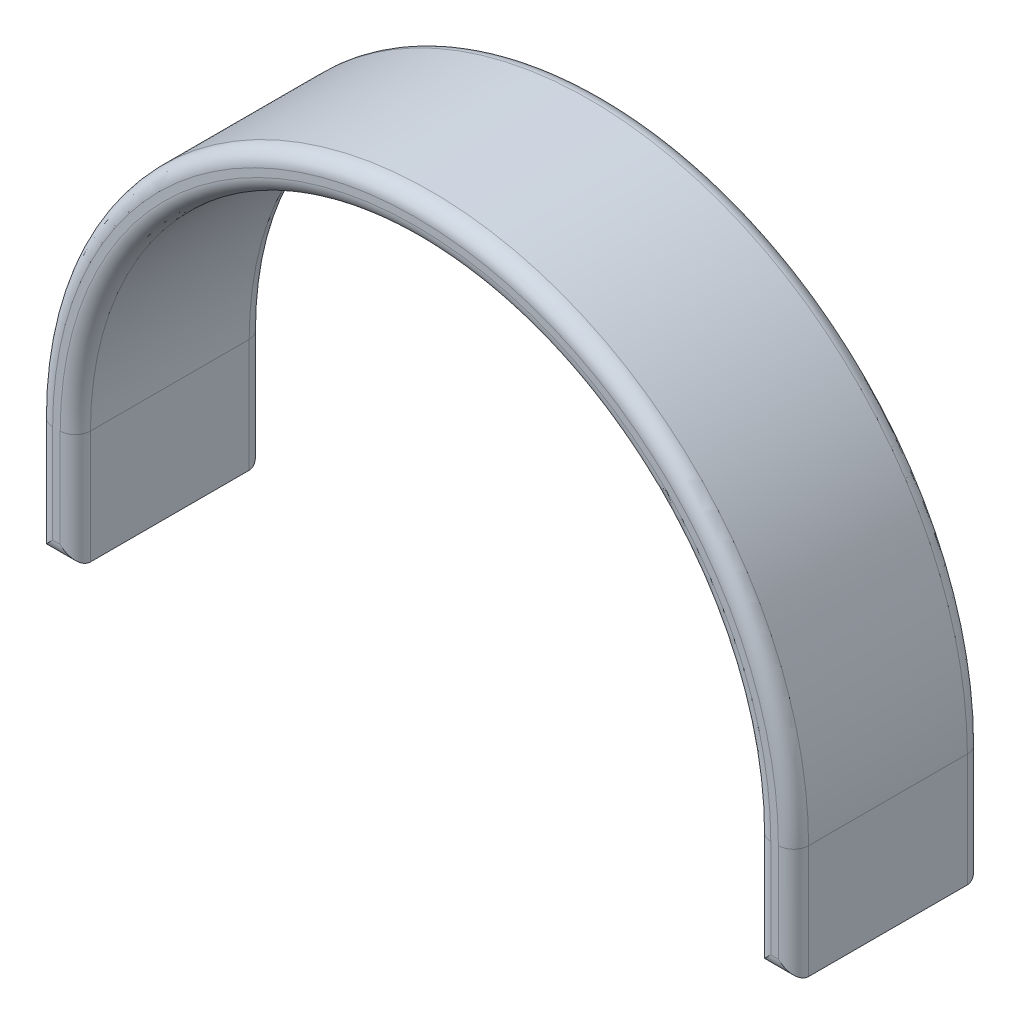
ISO-10303-21;
HEADER;
FILE_DESCRIPTION(('STEP AP214'),'2;1');
FILE_NAME('part.step','',(''),(''),'','','');
FILE_SCHEMA(('AUTOMOTIVE_DESIGN { 1 0 10303 214 1 1 1 1 }'));
ENDSEC;
DATA;
#1=APPLICATION_CONTEXT('core data for automotive mechanical design processes');
#2=APPLICATION_PROTOCOL_DEFINITION('international standard','automotive_design',2000,#1);
#3=PRODUCT_CONTEXT('',#1,'mechanical');
#4=PRODUCT('Part','Part','',(#3));
#5=PRODUCT_RELATED_PRODUCT_CATEGORY('part','',(#4));
#6=PRODUCT_DEFINITION_FORMATION('','',#4);
#7=PRODUCT_DEFINITION_CONTEXT('part definition',#1,'design');
#8=PRODUCT_DEFINITION('design','',#6,#7);
#9=PRODUCT_DEFINITION_SHAPE('','',#8);
#10=(LENGTH_UNIT() NAMED_UNIT(*) SI_UNIT(.MILLI.,.METRE.));
#11=(NAMED_UNIT(*) PLANE_ANGLE_UNIT() SI_UNIT($,.RADIAN.));
#12=(NAMED_UNIT(*) SI_UNIT($,.STERADIAN.) SOLID_ANGLE_UNIT());
#13=UNCERTAINTY_MEASURE_WITH_UNIT(LENGTH_MEASURE(1.E-05),#10,'distance_accuracy_value','');
#14=(GEOMETRIC_REPRESENTATION_CONTEXT(3) GLOBAL_UNCERTAINTY_ASSIGNED_CONTEXT((#13)) GLOBAL_UNIT_ASSIGNED_CONTEXT((#10,
#11,#12)) REPRESENTATION_CONTEXT('',''));
#15=CARTESIAN_POINT('',(0.,0.,0.));
#16=DIRECTION('',(0.,0.,1.));
#17=DIRECTION('',(1.,0.,0.));
#18=AXIS2_PLACEMENT_3D('',#15,#16,#17);
#19=CARTESIAN_POINT('',(0.,0.,25.));
#20=DIRECTION('',(0.,0.,-1.));
#21=DIRECTION('',(-1.,0.,0.));
#22=AXIS2_PLACEMENT_3D('',#19,#20,#21);
#23=CYLINDRICAL_SURFACE('',#22,50.);
#24=DIRECTION('',(0.,0.,-1.));
#25=VECTOR('',#24,1.);
#26=CARTESIAN_POINT('',(50.,0.,25.));
#27=LINE('',#26,#25);
#28=CARTESIAN_POINT('',(50.,0.,23.));
#29=VERTEX_POINT('',#28);
#30=CARTESIAN_POINT('',(50.,0.,2.));
#31=VERTEX_POINT('',#30);
#32=EDGE_CURVE('E271',#29,#31,#27,.T.);
#33=ORIENTED_EDGE('',*,*,#32,.T.);
#34=CARTESIAN_POINT('',(0.,0.,2.));
#35=DIRECTION('',(0.,0.,-1.));
#36=DIRECTION('',(-1.,0.,0.));
#37=AXIS2_PLACEMENT_3D('',#34,#35,#36);
#38=CIRCLE('',#37,50.);
#39=CARTESIAN_POINT('',(-50.,0.,2.));
#40=VERTEX_POINT('',#39);
#41=EDGE_CURVE('E236',#31,#40,#38,.F.);
#42=ORIENTED_EDGE('',*,*,#41,.T.);
#43=DIRECTION('',(0.,0.,-1.));
#44=VECTOR('',#43,1.);
#45=CARTESIAN_POINT('',(-50.,0.,25.));
#46=LINE('',#45,#44);
#47=CARTESIAN_POINT('',(-50.,0.,23.));
#48=VERTEX_POINT('',#47);
#49=EDGE_CURVE('E175',#48,#40,#46,.T.);
#50=ORIENTED_EDGE('',*,*,#49,.F.);
#51=CARTESIAN_POINT('',(0.,0.,23.));
#52=DIRECTION('',(0.,0.,-1.));
#53=DIRECTION('',(-1.,0.,0.));
#54=AXIS2_PLACEMENT_3D('',#51,#52,#53);
#55=CIRCLE('',#54,50.);
#56=EDGE_CURVE('E234',#48,#29,#55,.T.);
#57=ORIENTED_EDGE('',*,*,#56,.T.);
#58=EDGE_LOOP('',(#33,#42,#50,#57));
#59=FACE_BOUND('',#58,.T.);
#60=ADVANCED_FACE('F39',(#59),#23,.T.);
#61=CARTESIAN_POINT('',(-50.,0.,25.));
#62=DIRECTION('',(1.,0.,0.));
#63=DIRECTION('',(0.,0.,-1.));
#64=AXIS2_PLACEMENT_3D('',#61,#62,#63);
#65=PLANE('',#64);
#66=ORIENTED_EDGE('',*,*,#49,.T.);
#67=DIRECTION('',(0.,-1.,0.));
#68=VECTOR('',#67,1.);
#69=CARTESIAN_POINT('',(-50.,-15.,2.));
#70=LINE('',#69,#68);
#71=CARTESIAN_POINT('',(-50.,-15.,2.));
#72=VERTEX_POINT('',#71);
#73=EDGE_CURVE('E174',#40,#72,#70,.T.);
#74=ORIENTED_EDGE('',*,*,#73,.T.);
#75=DIRECTION('',(0.,0.,-1.));
#76=VECTOR('',#75,1.);
#77=CARTESIAN_POINT('',(-50.,-15.,25.));
#78=LINE('',#77,#76);
#79=CARTESIAN_POINT('',(-50.,-15.,23.));
#80=VERTEX_POINT('',#79);
#81=EDGE_CURVE('E156',#80,#72,#78,.T.);
#82=ORIENTED_EDGE('',*,*,#81,.F.);
#83=DIRECTION('',(0.,-1.,0.));
#84=VECTOR('',#83,1.);
#85=CARTESIAN_POINT('',(-50.,0.,23.));
#86=LINE('',#85,#84);
#87=EDGE_CURVE('E171',#80,#48,#86,.F.);
#88=ORIENTED_EDGE('',*,*,#87,.T.);
#89=EDGE_LOOP('',(#66,#74,#82,#88));
#90=FACE_BOUND('',#89,.T.);
#91=ADVANCED_FACE('F169',(#90),#65,.F.);
#92=CARTESIAN_POINT('',(-50.,-15.,25.));
#93=DIRECTION('',(0.,1.,0.));
#94=DIRECTION('',(0.,0.,1.));
#95=AXIS2_PLACEMENT_3D('',#92,#93,#94);
#96=PLANE('',#95);
#97=ORIENTED_EDGE('',*,*,#81,.T.);
#98=DIRECTION('',(1.,0.,0.));
#99=VECTOR('',#98,1.);
#100=CARTESIAN_POINT('',(-45.,-15.,2.));
#101=LINE('',#100,#99);
#102=CARTESIAN_POINT('',(-45.,-15.,2.));
#103=VERTEX_POINT('',#102);
#104=EDGE_CURVE('E163',#72,#103,#101,.T.);
#105=ORIENTED_EDGE('',*,*,#104,.T.);
#106=DIRECTION('',(0.,0.,-1.));
#107=VECTOR('',#106,1.);
#108=CARTESIAN_POINT('',(-45.,-15.,25.));
#109=LINE('',#108,#107);
#110=CARTESIAN_POINT('',(-45.,-15.,23.));
#111=VERTEX_POINT('',#110);
#112=EDGE_CURVE('E158',#111,#103,#109,.T.);
#113=ORIENTED_EDGE('',*,*,#112,.F.);
#114=DIRECTION('',(1.,0.,0.));
#115=VECTOR('',#114,1.);
#116=CARTESIAN_POINT('',(-50.,-15.,23.));
#117=LINE('',#116,#115);
#118=EDGE_CURVE('E153',#111,#80,#117,.F.);
#119=ORIENTED_EDGE('',*,*,#118,.T.);
#120=EDGE_LOOP('',(#97,#105,#113,#119));
#121=FACE_BOUND('',#120,.T.);
#122=ADVANCED_FACE('F155',(#121),#96,.F.);
#123=CARTESIAN_POINT('',(-45.,0.,25.));
#124=DIRECTION('',(-1.,0.,0.));
#125=DIRECTION('',(0.,0.,1.));
#126=AXIS2_PLACEMENT_3D('',#123,#124,#125);
#127=PLANE('',#126);
#128=ORIENTED_EDGE('',*,*,#112,.T.);
#129=DIRECTION('',(0.,1.,0.));
#130=VECTOR('',#129,1.);
#131=CARTESIAN_POINT('',(-45.,0.,2.));
#132=LINE('',#131,#130);
#133=CARTESIAN_POINT('',(-45.,0.,2.));
#134=VERTEX_POINT('',#133);
#135=EDGE_CURVE('E215',#103,#134,#132,.T.);
#136=ORIENTED_EDGE('',*,*,#135,.T.);
#137=DIRECTION('',(0.,0.,-1.));
#138=VECTOR('',#137,1.);
#139=CARTESIAN_POINT('',(-45.,0.,25.));
#140=LINE('',#139,#138);
#141=CARTESIAN_POINT('',(-45.,0.,23.));
#142=VERTEX_POINT('',#141);
#143=EDGE_CURVE('E296',#142,#134,#140,.T.);
#144=ORIENTED_EDGE('',*,*,#143,.F.);
#145=DIRECTION('',(0.,1.,0.));
#146=VECTOR('',#145,1.);
#147=CARTESIAN_POINT('',(-45.,0.,23.));
#148=LINE('',#147,#146);
#149=EDGE_CURVE('E213',#142,#111,#148,.F.);
#150=ORIENTED_EDGE('',*,*,#149,.T.);
#151=EDGE_LOOP('',(#128,#136,#144,#150));
#152=FACE_BOUND('',#151,.T.);
#153=ADVANCED_FACE('F293',(#152),#127,.F.);
#154=CARTESIAN_POINT('',(0.,0.,25.));
#155=DIRECTION('',(0.,0.,-1.));
#156=DIRECTION('',(-1.,0.,0.));
#157=AXIS2_PLACEMENT_3D('',#154,#155,#156);
#158=CYLINDRICAL_SURFACE('',#157,45.);
#159=ORIENTED_EDGE('',*,*,#143,.T.);
#160=CARTESIAN_POINT('',(0.,0.,2.));
#161=DIRECTION('',(0.,0.,-1.));
#162=DIRECTION('',(-1.,0.,0.));
#163=AXIS2_PLACEMENT_3D('',#160,#161,#162);
#164=CIRCLE('',#163,45.);
#165=CARTESIAN_POINT('',(45.,0.,2.));
#166=VERTEX_POINT('',#165);
#167=EDGE_CURVE('E219',#134,#166,#164,.T.);
#168=ORIENTED_EDGE('',*,*,#167,.T.);
#169=DIRECTION('',(0.,0.,-1.));
#170=VECTOR('',#169,1.);
#171=CARTESIAN_POINT('',(45.,0.,25.));
#172=LINE('',#171,#170);
#173=CARTESIAN_POINT('',(45.,0.,23.));
#174=VERTEX_POINT('',#173);
#175=EDGE_CURVE('E299',#174,#166,#172,.T.);
#176=ORIENTED_EDGE('',*,*,#175,.F.);
#177=CARTESIAN_POINT('',(0.,0.,23.));
#178=DIRECTION('',(0.,0.,-1.));
#179=DIRECTION('',(-1.,0.,0.));
#180=AXIS2_PLACEMENT_3D('',#177,#178,#179);
#181=CIRCLE('',#180,45.);
#182=EDGE_CURVE('E217',#174,#142,#181,.F.);
#183=ORIENTED_EDGE('',*,*,#182,.T.);
#184=EDGE_LOOP('',(#159,#168,#176,#183));
#185=FACE_BOUND('',#184,.T.);
#186=ADVANCED_FACE('F344',(#185),#158,.F.);
#187=CARTESIAN_POINT('',(45.,0.,25.));
#188=DIRECTION('',(1.,0.,0.));
#189=DIRECTION('',(0.,0.,-1.));
#190=AXIS2_PLACEMENT_3D('',#187,#188,#189);
#191=PLANE('',#190);
#192=ORIENTED_EDGE('',*,*,#175,.T.);
#193=DIRECTION('',(0.,-1.,0.));
#194=VECTOR('',#193,1.);
#195=CARTESIAN_POINT('',(45.,-15.,2.));
#196=LINE('',#195,#194);
#197=CARTESIAN_POINT('',(45.,-15.,2.));
#198=VERTEX_POINT('',#197);
#199=EDGE_CURVE('E223',#166,#198,#196,.T.);
#200=ORIENTED_EDGE('',*,*,#199,.T.);
#201=DIRECTION('',(0.,0.,-1.));
#202=VECTOR('',#201,1.);
#203=CARTESIAN_POINT('',(45.,-15.,25.));
#204=LINE('',#203,#202);
#205=CARTESIAN_POINT('',(45.,-15.,23.));
#206=VERTEX_POINT('',#205);
#207=EDGE_CURVE('E303',#206,#198,#204,.T.);
#208=ORIENTED_EDGE('',*,*,#207,.F.);
#209=DIRECTION('',(0.,-1.,0.));
#210=VECTOR('',#209,1.);
#211=CARTESIAN_POINT('',(45.,0.,23.));
#212=LINE('',#211,#210);
#213=EDGE_CURVE('E221',#206,#174,#212,.F.);
#214=ORIENTED_EDGE('',*,*,#213,.T.);
#215=EDGE_LOOP('',(#192,#200,#208,#214));
#216=FACE_BOUND('',#215,.T.);
#217=ADVANCED_FACE('F347',(#216),#191,.F.);
#218=CARTESIAN_POINT('',(45.,-15.,25.));
#219=DIRECTION('',(0.,1.,0.));
#220=DIRECTION('',(0.,0.,1.));
#221=AXIS2_PLACEMENT_3D('',#218,#219,#220);
#222=PLANE('',#221);
#223=ORIENTED_EDGE('',*,*,#207,.T.);
#224=DIRECTION('',(1.,0.,0.));
#225=VECTOR('',#224,1.);
#226=CARTESIAN_POINT('',(50.,-15.,2.));
#227=LINE('',#226,#225);
#228=CARTESIAN_POINT('',(50.,-15.,2.));
#229=VERTEX_POINT('',#228);
#230=EDGE_CURVE('E227',#198,#229,#227,.T.);
#231=ORIENTED_EDGE('',*,*,#230,.T.);
#232=DIRECTION('',(0.,0.,-1.));
#233=VECTOR('',#232,1.);
#234=CARTESIAN_POINT('',(50.,-15.,25.));
#235=LINE('',#234,#233);
#236=CARTESIAN_POINT('',(50.,-15.,23.));
#237=VERTEX_POINT('',#236);
#238=EDGE_CURVE('E308',#237,#229,#235,.T.);
#239=ORIENTED_EDGE('',*,*,#238,.F.);
#240=DIRECTION('',(1.,0.,0.));
#241=VECTOR('',#240,1.);
#242=CARTESIAN_POINT('',(45.,-15.,23.));
#243=LINE('',#242,#241);
#244=EDGE_CURVE('E225',#237,#206,#243,.F.);
#245=ORIENTED_EDGE('',*,*,#244,.T.);
#246=EDGE_LOOP('',(#223,#231,#239,#245));
#247=FACE_BOUND('',#246,.T.);
#248=ADVANCED_FACE('F361',(#247),#222,.F.);
#249=CARTESIAN_POINT('',(50.,0.,25.));
#250=DIRECTION('',(-1.,0.,0.));
#251=DIRECTION('',(0.,-1.,0.));
#252=AXIS2_PLACEMENT_3D('',#249,#250,#251);
#253=PLANE('',#252);
#254=ORIENTED_EDGE('',*,*,#238,.T.);
#255=DIRECTION('',(0.,1.,0.));
#256=VECTOR('',#255,1.);
#257=CARTESIAN_POINT('',(50.,0.,2.));
#258=LINE('',#257,#256);
#259=EDGE_CURVE('E232',#229,#31,#258,.T.);
#260=ORIENTED_EDGE('',*,*,#259,.T.);
#261=ORIENTED_EDGE('',*,*,#32,.F.);
#262=DIRECTION('',(0.,1.,0.));
#263=VECTOR('',#262,1.);
#264=CARTESIAN_POINT('',(50.,0.,23.));
#265=LINE('',#264,#263);
#266=EDGE_CURVE('E229',#29,#237,#265,.F.);
#267=ORIENTED_EDGE('',*,*,#266,.T.);
#268=EDGE_LOOP('',(#254,#260,#261,#267));
#269=FACE_BOUND('',#268,.T.);
#270=ADVANCED_FACE('F362',(#269),#253,.F.);
#271=CARTESIAN_POINT('',(0.,0.,25.));
#272=DIRECTION('',(0.,0.,-1.));
#273=DIRECTION('',(-1.,0.,0.));
#274=AXIS2_PLACEMENT_3D('',#271,#272,#273);
#275=PLANE('',#274);
#276=DIRECTION('',(1.,0.,0.));
#277=VECTOR('',#276,1.);
#278=CARTESIAN_POINT('',(0.,-13.,25.));
#279=LINE('',#278,#277);
#280=CARTESIAN_POINT('',(47.,-13.,25.));
#281=VERTEX_POINT('',#280);
#282=CARTESIAN_POINT('',(48.,-13.,25.));
#283=VERTEX_POINT('',#282);
#284=EDGE_CURVE('E48',#281,#283,#279,.T.);
#285=ORIENTED_EDGE('',*,*,#284,.T.);
#286=DIRECTION('',(0.,1.,0.));
#287=VECTOR('',#286,1.);
#288=CARTESIAN_POINT('',(48.,0.,25.));
#289=LINE('',#288,#287);
#290=CARTESIAN_POINT('',(48.,0.,25.));
#291=VERTEX_POINT('',#290);
#292=EDGE_CURVE('E11',#283,#291,#289,.T.);
#293=ORIENTED_EDGE('',*,*,#292,.T.);
#294=CARTESIAN_POINT('',(0.,0.,25.));
#295=DIRECTION('',(0.,0.,-1.));
#296=DIRECTION('',(-1.,0.,0.));
#297=AXIS2_PLACEMENT_3D('',#294,#295,#296);
#298=CIRCLE('',#297,48.);
#299=CARTESIAN_POINT('',(-48.,0.,25.));
#300=VERTEX_POINT('',#299);
#301=EDGE_CURVE('E238',#291,#300,#298,.F.);
#302=ORIENTED_EDGE('',*,*,#301,.T.);
#303=DIRECTION('',(0.,-1.,0.));
#304=VECTOR('',#303,1.);
#305=CARTESIAN_POINT('',(-48.,0.,25.));
#306=LINE('',#305,#304);
#307=CARTESIAN_POINT('',(-48.,-13.,25.));
#308=VERTEX_POINT('',#307);
#309=EDGE_CURVE('E240',#300,#308,#306,.T.);
#310=ORIENTED_EDGE('',*,*,#309,.T.);
#311=DIRECTION('',(1.,0.,0.));
#312=VECTOR('',#311,1.);
#313=CARTESIAN_POINT('',(0.,-13.,25.));
#314=LINE('',#313,#312);
#315=CARTESIAN_POINT('',(-47.,-13.,25.));
#316=VERTEX_POINT('',#315);
#317=EDGE_CURVE('E181',#308,#316,#314,.T.);
#318=ORIENTED_EDGE('',*,*,#317,.T.);
#319=DIRECTION('',(0.,1.,0.));
#320=VECTOR('',#319,1.);
#321=CARTESIAN_POINT('',(-47.,0.,25.));
#322=LINE('',#321,#320);
#323=CARTESIAN_POINT('',(-47.,0.,25.));
#324=VERTEX_POINT('',#323);
#325=EDGE_CURVE('E243',#316,#324,#322,.T.);
#326=ORIENTED_EDGE('',*,*,#325,.T.);
#327=CARTESIAN_POINT('',(0.,0.,25.));
#328=DIRECTION('',(0.,0.,-1.));
#329=DIRECTION('',(-1.,0.,0.));
#330=AXIS2_PLACEMENT_3D('',#327,#328,#329);
#331=CIRCLE('',#330,47.);
#332=CARTESIAN_POINT('',(47.,0.,25.));
#333=VERTEX_POINT('',#332);
#334=EDGE_CURVE('E245',#324,#333,#331,.T.);
#335=ORIENTED_EDGE('',*,*,#334,.T.);
#336=DIRECTION('',(0.,-1.,0.));
#337=VECTOR('',#336,1.);
#338=CARTESIAN_POINT('',(47.,0.,25.));
#339=LINE('',#338,#337);
#340=EDGE_CURVE('E59',#333,#281,#339,.T.);
#341=ORIENTED_EDGE('',*,*,#340,.T.);
#342=EDGE_LOOP('',(#285,#293,#302,#310,#318,#326,#335,#341));
#343=FACE_BOUND('',#342,.T.);
#344=ADVANCED_FACE('F371',(#343),#275,.F.);
#345=CARTESIAN_POINT('',(0.,0.,0.));
#346=DIRECTION('',(0.,0.,-1.));
#347=DIRECTION('',(-1.,0.,0.));
#348=AXIS2_PLACEMENT_3D('',#345,#346,#347);
#349=PLANE('',#348);
#350=DIRECTION('',(1.,0.,0.));
#351=VECTOR('',#350,1.);
#352=CARTESIAN_POINT('',(-50.,-13.,0.));
#353=LINE('',#352,#351);
#354=CARTESIAN_POINT('',(-47.,-13.,0.));
#355=VERTEX_POINT('',#354);
#356=CARTESIAN_POINT('',(-48.,-13.,0.));
#357=VERTEX_POINT('',#356);
#358=EDGE_CURVE('E208',#355,#357,#353,.F.);
#359=ORIENTED_EDGE('',*,*,#358,.T.);
#360=DIRECTION('',(0.,-1.,0.));
#361=VECTOR('',#360,1.);
#362=CARTESIAN_POINT('',(-48.,0.,0.));
#363=LINE('',#362,#361);
#364=CARTESIAN_POINT('',(-48.,0.,0.));
#365=VERTEX_POINT('',#364);
#366=EDGE_CURVE('E164',#357,#365,#363,.F.);
#367=ORIENTED_EDGE('',*,*,#366,.T.);
#368=CARTESIAN_POINT('',(0.,0.,0.));
#369=DIRECTION('',(0.,0.,-1.));
#370=DIRECTION('',(-1.,0.,0.));
#371=AXIS2_PLACEMENT_3D('',#368,#369,#370);
#372=CIRCLE('',#371,48.);
#373=CARTESIAN_POINT('',(48.,0.,0.));
#374=VERTEX_POINT('',#373);
#375=EDGE_CURVE('E193',#365,#374,#372,.T.);
#376=ORIENTED_EDGE('',*,*,#375,.T.);
#377=DIRECTION('',(0.,1.,0.));
#378=VECTOR('',#377,1.);
#379=CARTESIAN_POINT('',(48.,-15.,0.));
#380=LINE('',#379,#378);
#381=CARTESIAN_POINT('',(48.,-13.,0.));
#382=VERTEX_POINT('',#381);
#383=EDGE_CURVE('E198',#374,#382,#380,.F.);
#384=ORIENTED_EDGE('',*,*,#383,.T.);
#385=DIRECTION('',(1.,0.,0.));
#386=VECTOR('',#385,1.);
#387=CARTESIAN_POINT('',(45.,-13.,0.));
#388=LINE('',#387,#386);
#389=CARTESIAN_POINT('',(47.,-13.,0.));
#390=VERTEX_POINT('',#389);
#391=EDGE_CURVE('E200',#382,#390,#388,.F.);
#392=ORIENTED_EDGE('',*,*,#391,.T.);
#393=DIRECTION('',(0.,-1.,0.));
#394=VECTOR('',#393,1.);
#395=CARTESIAN_POINT('',(47.,0.,0.));
#396=LINE('',#395,#394);
#397=CARTESIAN_POINT('',(47.,0.,0.));
#398=VERTEX_POINT('',#397);
#399=EDGE_CURVE('E202',#390,#398,#396,.F.);
#400=ORIENTED_EDGE('',*,*,#399,.T.);
#401=CARTESIAN_POINT('',(0.,0.,0.));
#402=DIRECTION('',(0.,0.,-1.));
#403=DIRECTION('',(-1.,0.,0.));
#404=AXIS2_PLACEMENT_3D('',#401,#402,#403);
#405=CIRCLE('',#404,47.);
#406=CARTESIAN_POINT('',(-47.,0.,0.));
#407=VERTEX_POINT('',#406);
#408=EDGE_CURVE('E204',#398,#407,#405,.F.);
#409=ORIENTED_EDGE('',*,*,#408,.T.);
#410=DIRECTION('',(0.,1.,0.));
#411=VECTOR('',#410,1.);
#412=CARTESIAN_POINT('',(-47.,-15.,0.));
#413=LINE('',#412,#411);
#414=EDGE_CURVE('E206',#407,#355,#413,.F.);
#415=ORIENTED_EDGE('',*,*,#414,.T.);
#416=EDGE_LOOP('',(#359,#367,#376,#384,#392,#400,#409,#415));
#417=FACE_BOUND('',#416,.T.);
#418=ADVANCED_FACE('F373',(#417),#349,.T.);
#419=CARTESIAN_POINT('',(47.,0.,2.));
#420=DIRECTION('',(0.,1.,0.));
#421=DIRECTION('',(0.,0.,1.));
#422=AXIS2_PLACEMENT_3D('',#419,#420,#421);
#423=CYLINDRICAL_SURFACE('',#422,2.);
#424=CARTESIAN_POINT('',(47.,0.,2.));
#425=DIRECTION('',(0.,1.,0.));
#426=DIRECTION('',(-1.,0.,0.));
#427=AXIS2_PLACEMENT_3D('',#424,#425,#426);
#428=CIRCLE('',#427,2.);
#429=EDGE_CURVE('E265',#398,#166,#428,.T.);
#430=ORIENTED_EDGE('',*,*,#429,.F.);
#431=ORIENTED_EDGE('',*,*,#399,.F.);
#432=CARTESIAN_POINT('',(47.,-13.,2.));
#433=DIRECTION('',(-0.707106781186547,0.707106781186547,0.));
#434=DIRECTION('',(-0.707106781186547,-0.707106781186547,0.));
#435=AXIS2_PLACEMENT_3D('',#432,#433,#434);
#436=ELLIPSE('',#435,2.82842712474619,2.);
#437=EDGE_CURVE('E268',#198,#390,#436,.F.);
#438=ORIENTED_EDGE('',*,*,#437,.F.);
#439=ORIENTED_EDGE('',*,*,#199,.F.);
#440=EDGE_LOOP('',(#430,#431,#438,#439));
#441=FACE_BOUND('',#440,.T.);
#442=ADVANCED_FACE('F352',(#441),#423,.T.);
#443=CARTESIAN_POINT('',(45.,-13.,2.));
#444=DIRECTION('',(-1.,0.,0.));
#445=DIRECTION('',(0.,0.,1.));
#446=AXIS2_PLACEMENT_3D('',#443,#444,#445);
#447=CYLINDRICAL_SURFACE('',#446,2.);
#448=ORIENTED_EDGE('',*,*,#437,.T.);
#449=ORIENTED_EDGE('',*,*,#391,.F.);
#450=CARTESIAN_POINT('',(48.,-13.,2.));
#451=DIRECTION('',(-0.707106781186548,-0.707106781186547,0.));
#452=DIRECTION('',(0.707106781186547,-0.707106781186548,0.));
#453=AXIS2_PLACEMENT_3D('',#450,#451,#452);
#454=ELLIPSE('',#453,2.82842712474619,2.);
#455=EDGE_CURVE('E262',#229,#382,#454,.F.);
#456=ORIENTED_EDGE('',*,*,#455,.F.);
#457=ORIENTED_EDGE('',*,*,#230,.F.);
#458=EDGE_LOOP('',(#448,#449,#456,#457));
#459=FACE_BOUND('',#458,.T.);
#460=ADVANCED_FACE('F358',(#459),#447,.T.);
#461=CARTESIAN_POINT('',(0.,0.,2.));
#462=DIRECTION('',(0.,0.,-1.));
#463=DIRECTION('',(-1.,0.,0.));
#464=AXIS2_PLACEMENT_3D('',#461,#462,#463);
#465=TOROIDAL_SURFACE('',#464,47.,2.);
#466=ORIENTED_EDGE('',*,*,#429,.T.);
#467=ORIENTED_EDGE('',*,*,#167,.F.);
#468=CARTESIAN_POINT('',(-47.,0.,2.));
#469=DIRECTION('',(0.,-1.,0.));
#470=DIRECTION('',(0.,0.,-1.));
#471=AXIS2_PLACEMENT_3D('',#468,#469,#470);
#472=CIRCLE('',#471,2.);
#473=EDGE_CURVE('E259',#407,#134,#472,.T.);
#474=ORIENTED_EDGE('',*,*,#473,.F.);
#475=ORIENTED_EDGE('',*,*,#408,.F.);
#476=EDGE_LOOP('',(#466,#467,#474,#475));
#477=FACE_BOUND('',#476,.T.);
#478=ADVANCED_FACE('F341',(#477),#465,.T.);
#479=CARTESIAN_POINT('',(48.,0.,2.));
#480=DIRECTION('',(0.,-1.,0.));
#481=DIRECTION('',(1.,0.,0.));
#482=AXIS2_PLACEMENT_3D('',#479,#480,#481);
#483=CYLINDRICAL_SURFACE('',#482,2.);
#484=ORIENTED_EDGE('',*,*,#455,.T.);
#485=ORIENTED_EDGE('',*,*,#383,.F.);
#486=CARTESIAN_POINT('',(48.,0.,2.));
#487=DIRECTION('',(0.,1.,0.));
#488=DIRECTION('',(-1.,0.,0.));
#489=AXIS2_PLACEMENT_3D('',#486,#487,#488);
#490=CIRCLE('',#489,2.);
#491=EDGE_CURVE('E256',#31,#374,#490,.T.);
#492=ORIENTED_EDGE('',*,*,#491,.F.);
#493=ORIENTED_EDGE('',*,*,#259,.F.);
#494=EDGE_LOOP('',(#484,#485,#492,#493));
#495=FACE_BOUND('',#494,.T.);
#496=ADVANCED_FACE('F321',(#495),#483,.T.);
#497=CARTESIAN_POINT('',(-47.,0.,2.));
#498=DIRECTION('',(0.,-1.,0.));
#499=DIRECTION('',(0.,0.,-1.));
#500=AXIS2_PLACEMENT_3D('',#497,#498,#499);
#501=CYLINDRICAL_SURFACE('',#500,2.);
#502=ORIENTED_EDGE('',*,*,#473,.T.);
#503=ORIENTED_EDGE('',*,*,#135,.F.);
#504=CARTESIAN_POINT('',(-47.,-13.,2.));
#505=DIRECTION('',(-0.707106781186547,-0.707106781186547,0.));
#506=DIRECTION('',(0.707106781186547,-0.707106781186547,0.));
#507=AXIS2_PLACEMENT_3D('',#504,#505,#506);
#508=ELLIPSE('',#507,2.82842712474619,2.);
#509=EDGE_CURVE('E253',#355,#103,#508,.T.);
#510=ORIENTED_EDGE('',*,*,#509,.F.);
#511=ORIENTED_EDGE('',*,*,#414,.F.);
#512=EDGE_LOOP('',(#502,#503,#510,#511));
#513=FACE_BOUND('',#512,.T.);
#514=ADVANCED_FACE('F337',(#513),#501,.T.);
#515=CARTESIAN_POINT('',(0.,0.,2.));
#516=DIRECTION('',(0.,0.,-1.));
#517=DIRECTION('',(-1.,0.,0.));
#518=AXIS2_PLACEMENT_3D('',#515,#516,#517);
#519=TOROIDAL_SURFACE('',#518,48.,2.);
#520=ORIENTED_EDGE('',*,*,#491,.T.);
#521=ORIENTED_EDGE('',*,*,#375,.F.);
#522=CARTESIAN_POINT('',(-48.,0.,2.));
#523=DIRECTION('',(0.,-1.,0.));
#524=DIRECTION('',(0.,0.,-1.));
#525=AXIS2_PLACEMENT_3D('',#522,#523,#524);
#526=CIRCLE('',#525,2.);
#527=EDGE_CURVE('E251',#40,#365,#526,.T.);
#528=ORIENTED_EDGE('',*,*,#527,.F.);
#529=ORIENTED_EDGE('',*,*,#41,.F.);
#530=EDGE_LOOP('',(#520,#521,#528,#529));
#531=FACE_BOUND('',#530,.T.);
#532=ADVANCED_FACE('F325',(#531),#519,.T.);
#533=CARTESIAN_POINT('',(-50.,-13.,2.));
#534=DIRECTION('',(-1.,0.,0.));
#535=DIRECTION('',(0.,0.,1.));
#536=AXIS2_PLACEMENT_3D('',#533,#534,#535);
#537=CYLINDRICAL_SURFACE('',#536,2.);
#538=ORIENTED_EDGE('',*,*,#509,.T.);
#539=ORIENTED_EDGE('',*,*,#104,.F.);
#540=CARTESIAN_POINT('',(-48.,-13.,2.));
#541=DIRECTION('',(-0.707106781186547,0.707106781186547,0.));
#542=DIRECTION('',(-0.707106781186547,-0.707106781186547,0.));
#543=AXIS2_PLACEMENT_3D('',#540,#541,#542);
#544=ELLIPSE('',#543,2.82842712474619,2.);
#545=EDGE_CURVE('E249',#357,#72,#544,.T.);
#546=ORIENTED_EDGE('',*,*,#545,.F.);
#547=ORIENTED_EDGE('',*,*,#358,.F.);
#548=EDGE_LOOP('',(#538,#539,#546,#547));
#549=FACE_BOUND('',#548,.T.);
#550=ADVANCED_FACE('F333',(#549),#537,.T.);
#551=CARTESIAN_POINT('',(-48.,0.,2.));
#552=DIRECTION('',(0.,1.,0.));
#553=DIRECTION('',(0.,0.,1.));
#554=AXIS2_PLACEMENT_3D('',#551,#552,#553);
#555=CYLINDRICAL_SURFACE('',#554,2.);
#556=ORIENTED_EDGE('',*,*,#527,.T.);
#557=ORIENTED_EDGE('',*,*,#366,.F.);
#558=ORIENTED_EDGE('',*,*,#545,.T.);
#559=ORIENTED_EDGE('',*,*,#73,.F.);
#560=EDGE_LOOP('',(#556,#557,#558,#559));
#561=FACE_BOUND('',#560,.T.);
#562=ADVANCED_FACE('F328',(#561),#555,.T.);
#563=CARTESIAN_POINT('',(-47.,0.,23.));
#564=DIRECTION('',(0.,1.,0.));
#565=DIRECTION('',(0.,0.,1.));
#566=AXIS2_PLACEMENT_3D('',#563,#564,#565);
#567=CYLINDRICAL_SURFACE('',#566,2.);
#568=CARTESIAN_POINT('',(-47.,-13.,23.));
#569=DIRECTION('',(0.707106781186547,0.707106781186547,0.));
#570=DIRECTION('',(0.707106781186547,-0.707106781186547,0.));
#571=AXIS2_PLACEMENT_3D('',#568,#569,#570);
#572=ELLIPSE('',#571,2.82842712474619,2.);
#573=EDGE_CURVE('E280',#111,#316,#572,.F.);
#574=ORIENTED_EDGE('',*,*,#573,.F.);
#575=ORIENTED_EDGE('',*,*,#149,.F.);
#576=CARTESIAN_POINT('',(-47.,0.,23.));
#577=DIRECTION('',(0.,1.,0.));
#578=DIRECTION('',(-1.,0.,0.));
#579=AXIS2_PLACEMENT_3D('',#576,#577,#578);
#580=CIRCLE('',#579,2.);
#581=EDGE_CURVE('E43',#324,#142,#580,.T.);
#582=ORIENTED_EDGE('',*,*,#581,.F.);
#583=ORIENTED_EDGE('',*,*,#325,.F.);
#584=EDGE_LOOP('',(#574,#575,#582,#583));
#585=FACE_BOUND('',#584,.T.);
#586=ADVANCED_FACE('F41',(#585),#567,.T.);
#587=CARTESIAN_POINT('',(0.,0.,23.));
#588=DIRECTION('',(0.,0.,-1.));
#589=DIRECTION('',(-1.,0.,0.));
#590=AXIS2_PLACEMENT_3D('',#587,#588,#589);
#591=TOROIDAL_SURFACE('',#590,47.,2.);
#592=ORIENTED_EDGE('',*,*,#581,.T.);
#593=ORIENTED_EDGE('',*,*,#182,.F.);
#594=CARTESIAN_POINT('',(47.,0.,23.));
#595=DIRECTION('',(0.,-1.,0.));
#596=DIRECTION('',(0.,0.,-1.));
#597=AXIS2_PLACEMENT_3D('',#594,#595,#596);
#598=CIRCLE('',#597,2.);
#599=EDGE_CURVE('E184',#333,#174,#598,.T.);
#600=ORIENTED_EDGE('',*,*,#599,.F.);
#601=ORIENTED_EDGE('',*,*,#334,.F.);
#602=EDGE_LOOP('',(#592,#593,#600,#601));
#603=FACE_BOUND('',#602,.T.);
#604=ADVANCED_FACE('F286',(#603),#591,.T.);
#605=CARTESIAN_POINT('',(0.,-13.,23.));
#606=DIRECTION('',(1.,0.,0.));
#607=DIRECTION('',(0.,0.,-1.));
#608=AXIS2_PLACEMENT_3D('',#605,#606,#607);
#609=CYLINDRICAL_SURFACE('',#608,2.);
#610=ORIENTED_EDGE('',*,*,#573,.T.);
#611=ORIENTED_EDGE('',*,*,#317,.F.);
#612=CARTESIAN_POINT('',(-48.,-13.,23.));
#613=DIRECTION('',(0.707106781186547,-0.707106781186547,0.));
#614=DIRECTION('',(-0.707106781186547,-0.707106781186547,0.));
#615=AXIS2_PLACEMENT_3D('',#612,#613,#614);
#616=ELLIPSE('',#615,2.82842712474619,2.);
#617=EDGE_CURVE('E179',#80,#308,#616,.F.);
#618=ORIENTED_EDGE('',*,*,#617,.F.);
#619=ORIENTED_EDGE('',*,*,#118,.F.);
#620=EDGE_LOOP('',(#610,#611,#618,#619));
#621=FACE_BOUND('',#620,.T.);
#622=ADVANCED_FACE('F180',(#621),#609,.T.);
#623=CARTESIAN_POINT('',(47.,0.,23.));
#624=DIRECTION('',(0.,-1.,0.));
#625=DIRECTION('',(0.,0.,-1.));
#626=AXIS2_PLACEMENT_3D('',#623,#624,#625);
#627=CYLINDRICAL_SURFACE('',#626,2.);
#628=ORIENTED_EDGE('',*,*,#599,.T.);
#629=ORIENTED_EDGE('',*,*,#213,.F.);
#630=CARTESIAN_POINT('',(47.,-13.,23.));
#631=DIRECTION('',(0.707106781186547,-0.707106781186547,0.));
#632=DIRECTION('',(-0.707106781186547,-0.707106781186547,0.));
#633=AXIS2_PLACEMENT_3D('',#630,#631,#632);
#634=ELLIPSE('',#633,2.82842712474619,2.);
#635=EDGE_CURVE('E185',#281,#206,#634,.T.);
#636=ORIENTED_EDGE('',*,*,#635,.F.);
#637=ORIENTED_EDGE('',*,*,#340,.F.);
#638=EDGE_LOOP('',(#628,#629,#636,#637));
#639=FACE_BOUND('',#638,.T.);
#640=ADVANCED_FACE('F416',(#639),#627,.T.);
#641=CARTESIAN_POINT('',(-48.,0.,23.));
#642=DIRECTION('',(0.,-1.,0.));
#643=DIRECTION('',(0.,0.,-1.));
#644=AXIS2_PLACEMENT_3D('',#641,#642,#643);
#645=CYLINDRICAL_SURFACE('',#644,2.);
#646=ORIENTED_EDGE('',*,*,#617,.T.);
#647=ORIENTED_EDGE('',*,*,#309,.F.);
#648=CARTESIAN_POINT('',(-48.,0.,23.));
#649=DIRECTION('',(0.,1.,0.));
#650=DIRECTION('',(0.,0.,1.));
#651=AXIS2_PLACEMENT_3D('',#648,#649,#650);
#652=CIRCLE('',#651,2.);
#653=EDGE_CURVE('E190',#48,#300,#652,.T.);
#654=ORIENTED_EDGE('',*,*,#653,.F.);
#655=ORIENTED_EDGE('',*,*,#87,.F.);
#656=EDGE_LOOP('',(#646,#647,#654,#655));
#657=FACE_BOUND('',#656,.T.);
#658=ADVANCED_FACE('F188',(#657),#645,.T.);
#659=CARTESIAN_POINT('',(0.,-13.,23.));
#660=DIRECTION('',(1.,0.,0.));
#661=DIRECTION('',(0.,0.,-1.));
#662=AXIS2_PLACEMENT_3D('',#659,#660,#661);
#663=CYLINDRICAL_SURFACE('',#662,2.);
#664=ORIENTED_EDGE('',*,*,#635,.T.);
#665=ORIENTED_EDGE('',*,*,#244,.F.);
#666=CARTESIAN_POINT('',(48.,-13.,23.));
#667=DIRECTION('',(0.707106781186548,0.707106781186547,0.));
#668=DIRECTION('',(0.707106781186547,-0.707106781186548,0.));
#669=AXIS2_PLACEMENT_3D('',#666,#667,#668);
#670=ELLIPSE('',#669,2.82842712474619,2.);
#671=EDGE_CURVE('E274',#283,#237,#670,.T.);
#672=ORIENTED_EDGE('',*,*,#671,.F.);
#673=ORIENTED_EDGE('',*,*,#284,.F.);
#674=EDGE_LOOP('',(#664,#665,#672,#673));
#675=FACE_BOUND('',#674,.T.);
#676=ADVANCED_FACE('F410',(#675),#663,.T.);
#677=CARTESIAN_POINT('',(0.,0.,23.));
#678=DIRECTION('',(0.,0.,-1.));
#679=DIRECTION('',(-1.,0.,0.));
#680=AXIS2_PLACEMENT_3D('',#677,#678,#679);
#681=TOROIDAL_SURFACE('',#680,48.,2.);
#682=ORIENTED_EDGE('',*,*,#653,.T.);
#683=ORIENTED_EDGE('',*,*,#301,.F.);
#684=CARTESIAN_POINT('',(48.,0.,23.));
#685=DIRECTION('',(0.,-1.,0.));
#686=DIRECTION('',(0.,0.,-1.));
#687=AXIS2_PLACEMENT_3D('',#684,#685,#686);
#688=CIRCLE('',#687,2.);
#689=EDGE_CURVE('E272',#29,#291,#688,.T.);
#690=ORIENTED_EDGE('',*,*,#689,.F.);
#691=ORIENTED_EDGE('',*,*,#56,.F.);
#692=EDGE_LOOP('',(#682,#683,#690,#691));
#693=FACE_BOUND('',#692,.T.);
#694=ADVANCED_FACE('F370',(#693),#681,.T.);
#695=CARTESIAN_POINT('',(48.,0.,23.));
#696=DIRECTION('',(0.,1.,0.));
#697=DIRECTION('',(-1.,0.,0.));
#698=AXIS2_PLACEMENT_3D('',#695,#696,#697);
#699=CYLINDRICAL_SURFACE('',#698,2.);
#700=ORIENTED_EDGE('',*,*,#671,.T.);
#701=ORIENTED_EDGE('',*,*,#266,.F.);
#702=ORIENTED_EDGE('',*,*,#689,.T.);
#703=ORIENTED_EDGE('',*,*,#292,.F.);
#704=EDGE_LOOP('',(#700,#701,#702,#703));
#705=FACE_BOUND('',#704,.T.);
#706=ADVANCED_FACE('F365',(#705),#699,.T.);
#707=CLOSED_SHELL('',(#60,#91,#122,#153,#186,#217,#248,#270,#344,#418,#442,#460,#478,#496,#514,
#532,#550,#562,#586,#604,#622,#640,#658,#676,#694,#706));
#708=MANIFOLD_SOLID_BREP('B2',#707);
#709=ADVANCED_BREP_SHAPE_REPRESENTATION('',(#18,#708),#14);
#710=SHAPE_DEFINITION_REPRESENTATION(#9,#709);
ENDSEC;
END-ISO-10303-21;
